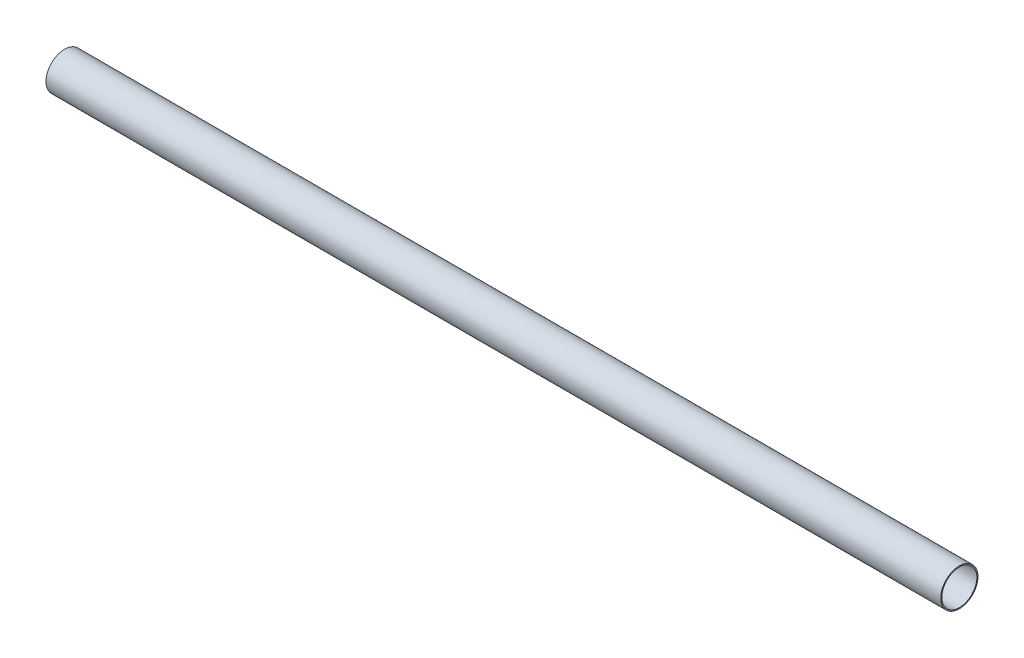
ISO-10303-21;
HEADER;
FILE_DESCRIPTION(('STEP AP214'),'2;1');
FILE_NAME('part.step','',(''),(''),'','','');
FILE_SCHEMA(('AUTOMOTIVE_DESIGN { 1 0 10303 214 1 1 1 1 }'));
ENDSEC;
DATA;
#1=APPLICATION_CONTEXT('core data for automotive mechanical design processes');
#2=APPLICATION_PROTOCOL_DEFINITION('international standard','automotive_design',2000,#1);
#3=PRODUCT_CONTEXT('',#1,'mechanical');
#4=PRODUCT('Part','Part','',(#3));
#5=PRODUCT_RELATED_PRODUCT_CATEGORY('part','',(#4));
#6=PRODUCT_DEFINITION_FORMATION('','',#4);
#7=PRODUCT_DEFINITION_CONTEXT('part definition',#1,'design');
#8=PRODUCT_DEFINITION('design','',#6,#7);
#9=PRODUCT_DEFINITION_SHAPE('','',#8);
#10=(LENGTH_UNIT() NAMED_UNIT(*) SI_UNIT(.MILLI.,.METRE.));
#11=(NAMED_UNIT(*) PLANE_ANGLE_UNIT() SI_UNIT($,.RADIAN.));
#12=(NAMED_UNIT(*) SI_UNIT($,.STERADIAN.) SOLID_ANGLE_UNIT());
#13=UNCERTAINTY_MEASURE_WITH_UNIT(LENGTH_MEASURE(1.E-05),#10,'distance_accuracy_value','');
#14=(GEOMETRIC_REPRESENTATION_CONTEXT(3) GLOBAL_UNCERTAINTY_ASSIGNED_CONTEXT((#13)) GLOBAL_UNIT_ASSIGNED_CONTEXT((#10,
#11,#12)) REPRESENTATION_CONTEXT('',''));
#15=CARTESIAN_POINT('',(0.,0.,0.));
#16=DIRECTION('',(0.,0.,1.));
#17=DIRECTION('',(1.,0.,0.));
#18=AXIS2_PLACEMENT_3D('',#15,#16,#17);
#19=CARTESIAN_POINT('',(495.3,0.,0.));
#20=DIRECTION('',(1.,0.,0.));
#21=DIRECTION('',(0.,0.,-1.));
#22=AXIS2_PLACEMENT_3D('',#19,#20,#21);
#23=PLANE('',#22);
#24=CARTESIAN_POINT('',(495.3,0.,0.));
#25=DIRECTION('',(1.,0.,0.));
#26=DIRECTION('',(0.,0.,-1.));
#27=AXIS2_PLACEMENT_3D('',#24,#25,#26);
#28=CIRCLE('',#27,20.6375);
#29=CARTESIAN_POINT('',(495.3,0.,-20.6375));
#30=VERTEX_POINT('',#29);
#31=EDGE_CURVE('E10',#30,#30,#28,.T.);
#32=ORIENTED_EDGE('',*,*,#31,.T.);
#33=EDGE_LOOP('',(#32));
#34=FACE_BOUND('',#33,.T.);
#35=CARTESIAN_POINT('',(495.3,0.,0.));
#36=DIRECTION('',(1.,0.,0.));
#37=DIRECTION('',(0.,0.,-1.));
#38=AXIS2_PLACEMENT_3D('',#35,#36,#37);
#39=CIRCLE('',#38,19.3929);
#40=CARTESIAN_POINT('',(495.3,0.,-19.3929));
#41=VERTEX_POINT('',#40);
#42=EDGE_CURVE('E50',#41,#41,#39,.T.);
#43=ORIENTED_EDGE('',*,*,#42,.F.);
#44=EDGE_LOOP('',(#43));
#45=FACE_BOUND('',#44,.T.);
#46=ADVANCED_FACE('F37',(#34,#45),#23,.T.);
#47=CARTESIAN_POINT('',(-495.3,0.,0.));
#48=DIRECTION('',(1.,0.,0.));
#49=DIRECTION('',(0.,0.,-1.));
#50=AXIS2_PLACEMENT_3D('',#47,#48,#49);
#51=PLANE('',#50);
#52=CARTESIAN_POINT('',(-495.3,0.,0.));
#53=DIRECTION('',(1.,0.,0.));
#54=DIRECTION('',(0.,0.,-1.));
#55=AXIS2_PLACEMENT_3D('',#52,#53,#54);
#56=CIRCLE('',#55,20.6375);
#57=CARTESIAN_POINT('',(-495.3,0.,-20.6375));
#58=VERTEX_POINT('',#57);
#59=EDGE_CURVE('E41',#58,#58,#56,.T.);
#60=ORIENTED_EDGE('',*,*,#59,.F.);
#61=EDGE_LOOP('',(#60));
#62=FACE_BOUND('',#61,.T.);
#63=CARTESIAN_POINT('',(-495.3,0.,0.));
#64=DIRECTION('',(1.,0.,0.));
#65=DIRECTION('',(0.,0.,-1.));
#66=AXIS2_PLACEMENT_3D('',#63,#64,#65);
#67=CIRCLE('',#66,19.3929);
#68=CARTESIAN_POINT('',(-495.3,0.,-19.3929));
#69=VERTEX_POINT('',#68);
#70=EDGE_CURVE('E52',#69,#69,#67,.T.);
#71=ORIENTED_EDGE('',*,*,#70,.T.);
#72=EDGE_LOOP('',(#71));
#73=FACE_BOUND('',#72,.T.);
#74=ADVANCED_FACE('F64',(#62,#73),#51,.F.);
#75=CARTESIAN_POINT('',(495.3,0.,0.));
#76=DIRECTION('',(-1.,0.,0.));
#77=DIRECTION('',(0.,0.,1.));
#78=AXIS2_PLACEMENT_3D('',#75,#76,#77);
#79=CYLINDRICAL_SURFACE('',#78,20.6375);
#80=ORIENTED_EDGE('',*,*,#31,.F.);
#81=EDGE_LOOP('',(#80));
#82=FACE_BOUND('',#81,.T.);
#83=ORIENTED_EDGE('',*,*,#59,.T.);
#84=EDGE_LOOP('',(#83));
#85=FACE_BOUND('',#84,.T.);
#86=ADVANCED_FACE('F39',(#82,#85),#79,.T.);
#87=CARTESIAN_POINT('',(495.3,0.,0.));
#88=DIRECTION('',(-1.,0.,0.));
#89=DIRECTION('',(0.,0.,1.));
#90=AXIS2_PLACEMENT_3D('',#87,#88,#89);
#91=CYLINDRICAL_SURFACE('',#90,19.3929);
#92=ORIENTED_EDGE('',*,*,#42,.T.);
#93=EDGE_LOOP('',(#92));
#94=FACE_BOUND('',#93,.T.);
#95=ORIENTED_EDGE('',*,*,#70,.F.);
#96=EDGE_LOOP('',(#95));
#97=FACE_BOUND('',#96,.T.);
#98=ADVANCED_FACE('F60',(#94,#97),#91,.F.);
#99=CLOSED_SHELL('',(#46,#74,#86,#98));
#100=MANIFOLD_SOLID_BREP('B2',#99);
#101=ADVANCED_BREP_SHAPE_REPRESENTATION('',(#18,#100),#14);
#102=SHAPE_DEFINITION_REPRESENTATION(#9,#101);
ENDSEC;
END-ISO-10303-21;
